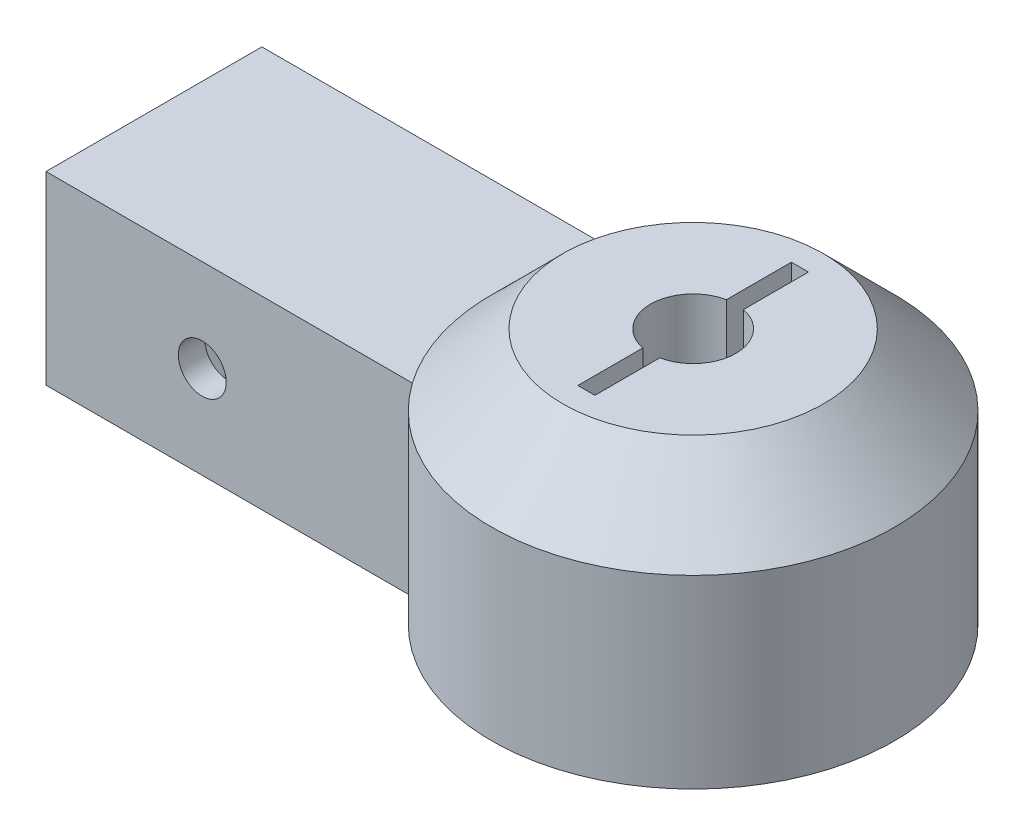
ISO-10303-21;
HEADER;
FILE_DESCRIPTION(('STEP AP214'),'2;1');
FILE_NAME('part.step','',(''),(''),'','','');
FILE_SCHEMA(('AUTOMOTIVE_DESIGN { 1 0 10303 214 1 1 1 1 }'));
ENDSEC;
DATA;
#1=APPLICATION_CONTEXT('core data for automotive mechanical design processes');
#2=APPLICATION_PROTOCOL_DEFINITION('international standard','automotive_design',2000,#1);
#3=PRODUCT_CONTEXT('',#1,'mechanical');
#4=PRODUCT('Part','Part','',(#3));
#5=PRODUCT_RELATED_PRODUCT_CATEGORY('part','',(#4));
#6=PRODUCT_DEFINITION_FORMATION('','',#4);
#7=PRODUCT_DEFINITION_CONTEXT('part definition',#1,'design');
#8=PRODUCT_DEFINITION('design','',#6,#7);
#9=PRODUCT_DEFINITION_SHAPE('','',#8);
#10=(LENGTH_UNIT() NAMED_UNIT(*) SI_UNIT(.MILLI.,.METRE.));
#11=(NAMED_UNIT(*) PLANE_ANGLE_UNIT() SI_UNIT($,.RADIAN.));
#12=(NAMED_UNIT(*) SI_UNIT($,.STERADIAN.) SOLID_ANGLE_UNIT());
#13=UNCERTAINTY_MEASURE_WITH_UNIT(LENGTH_MEASURE(1.E-05),#10,'distance_accuracy_value','');
#14=(GEOMETRIC_REPRESENTATION_CONTEXT(3) GLOBAL_UNCERTAINTY_ASSIGNED_CONTEXT((#13)) GLOBAL_UNIT_ASSIGNED_CONTEXT((#10,
#11,#12)) REPRESENTATION_CONTEXT('',''));
#15=CARTESIAN_POINT('',(0.,0.,0.));
#16=DIRECTION('',(0.,0.,1.));
#17=DIRECTION('',(1.,0.,0.));
#18=AXIS2_PLACEMENT_3D('',#15,#16,#17);
#19=CARTESIAN_POINT('',(0.,13.,0.));
#20=DIRECTION('',(0.,1.,0.));
#21=DIRECTION('',(0.,0.,1.));
#22=AXIS2_PLACEMENT_3D('',#19,#20,#21);
#23=PLANE('',#22);
#24=CARTESIAN_POINT('',(0.,13.,0.));
#25=DIRECTION('',(0.,1.,0.));
#26=DIRECTION('',(0.,0.,1.));
#27=AXIS2_PLACEMENT_3D('',#24,#25,#26);
#28=CIRCLE('',#27,14.15);
#29=CARTESIAN_POINT('',(-12.2972557914357,13.,-7.));
#30=VERTEX_POINT('',#29);
#31=CARTESIAN_POINT('',(-11.5594120985335,13.,8.16103497947882));
#32=VERTEX_POINT('',#31);
#33=EDGE_CURVE('E200',#30,#32,#28,.T.);
#34=ORIENTED_EDGE('',*,*,#33,.F.);
#35=DIRECTION('',(-1.,0.,0.));
#36=VECTOR('',#35,1.);
#37=CARTESIAN_POINT('',(-12.2972557914357,13.,-7.));
#38=LINE('',#37,#36);
#39=CARTESIAN_POINT('',(-37.2972557914357,13.,-7.));
#40=VERTEX_POINT('',#39);
#41=EDGE_CURVE('E344',#30,#40,#38,.T.);
#42=ORIENTED_EDGE('',*,*,#41,.T.);
#43=DIRECTION('',(0.,0.,1.));
#44=VECTOR('',#43,1.);
#45=CARTESIAN_POINT('',(-37.2972557914357,13.,8.16103497947882));
#46=LINE('',#45,#44);
#47=CARTESIAN_POINT('',(-37.2972557914357,13.,8.16103497947882));
#48=VERTEX_POINT('',#47);
#49=EDGE_CURVE('E346',#40,#48,#46,.T.);
#50=ORIENTED_EDGE('',*,*,#49,.T.);
#51=DIRECTION('',(1.,0.,0.));
#52=VECTOR('',#51,1.);
#53=CARTESIAN_POINT('',(-37.2972557914357,13.,8.16103497947882));
#54=LINE('',#53,#52);
#55=EDGE_CURVE('E349',#48,#32,#54,.T.);
#56=ORIENTED_EDGE('',*,*,#55,.T.);
#57=EDGE_LOOP('',(#34,#42,#50,#56));
#58=FACE_BOUND('',#57,.T.);
#59=ADVANCED_FACE('F33',(#58),#23,.T.);
#60=CARTESIAN_POINT('',(0.,0.,0.));
#61=DIRECTION('',(0.,1.,0.));
#62=DIRECTION('',(0.,0.,1.));
#63=AXIS2_PLACEMENT_3D('',#60,#61,#62);
#64=PLANE('',#63);
#65=CARTESIAN_POINT('',(0.,0.,0.));
#66=DIRECTION('',(0.,1.,0.));
#67=DIRECTION('',(0.,0.,1.));
#68=AXIS2_PLACEMENT_3D('',#65,#66,#67);
#69=CIRCLE('',#68,14.15);
#70=CARTESIAN_POINT('',(-11.5594120985335,0.,8.16103497947882));
#71=VERTEX_POINT('',#70);
#72=CARTESIAN_POINT('',(-12.2972557914357,0.,-7.));
#73=VERTEX_POINT('',#72);
#74=EDGE_CURVE('E343',#71,#73,#69,.T.);
#75=ORIENTED_EDGE('',*,*,#74,.F.);
#76=DIRECTION('',(1.,0.,0.));
#77=VECTOR('',#76,1.);
#78=CARTESIAN_POINT('',(-37.2972557914357,0.,8.16103497947882));
#79=LINE('',#78,#77);
#80=CARTESIAN_POINT('',(-37.2972557914357,0.,8.16103497947882));
#81=VERTEX_POINT('',#80);
#82=EDGE_CURVE('E347',#81,#71,#79,.T.);
#83=ORIENTED_EDGE('',*,*,#82,.F.);
#84=DIRECTION('',(0.,0.,1.));
#85=VECTOR('',#84,1.);
#86=CARTESIAN_POINT('',(-37.2972557914357,0.,8.16103497947882));
#87=LINE('',#86,#85);
#88=CARTESIAN_POINT('',(-37.2972557914357,0.,-7.));
#89=VERTEX_POINT('',#88);
#90=EDGE_CURVE('E357',#89,#81,#87,.T.);
#91=ORIENTED_EDGE('',*,*,#90,.F.);
#92=DIRECTION('',(-1.,0.,0.));
#93=VECTOR('',#92,1.);
#94=CARTESIAN_POINT('',(-12.2972557914357,0.,-7.));
#95=LINE('',#94,#93);
#96=EDGE_CURVE('E355',#73,#89,#95,.T.);
#97=ORIENTED_EDGE('',*,*,#96,.F.);
#98=EDGE_LOOP('',(#75,#83,#91,#97));
#99=FACE_BOUND('',#98,.T.);
#100=CARTESIAN_POINT('',(0.,0.,0.));
#101=DIRECTION('',(0.,1.,0.));
#102=DIRECTION('',(0.,0.,1.));
#103=AXIS2_PLACEMENT_3D('',#100,#101,#102);
#104=CIRCLE('',#103,11.15);
#105=CARTESIAN_POINT('',(0.,0.,-11.15));
#106=VERTEX_POINT('',#105);
#107=EDGE_CURVE('E333',#106,#106,#104,.T.);
#108=ORIENTED_EDGE('',*,*,#107,.T.);
#109=EDGE_LOOP('',(#108));
#110=FACE_BOUND('',#109,.T.);
#111=ADVANCED_FACE('F384',(#99,#110),#64,.F.);
#112=CARTESIAN_POINT('',(0.,13.,0.));
#113=DIRECTION('',(0.,-1.,0.));
#114=DIRECTION('',(0.,0.,-1.));
#115=AXIS2_PLACEMENT_3D('',#112,#113,#114);
#116=CYLINDRICAL_SURFACE('',#115,14.15);
#117=DIRECTION('',(0.,-1.,0.));
#118=VECTOR('',#117,1.);
#119=CARTESIAN_POINT('',(-12.2972557914357,13.,-7.));
#120=LINE('',#119,#118);
#121=EDGE_CURVE('E368',#30,#73,#120,.T.);
#122=ORIENTED_EDGE('',*,*,#121,.F.);
#123=CARTESIAN_POINT('',(0.,13.,0.));
#124=DIRECTION('',(0.,1.,0.));
#125=DIRECTION('',(0.,0.,1.));
#126=AXIS2_PLACEMENT_3D('',#123,#124,#125);
#127=CIRCLE('',#126,14.15);
#128=EDGE_CURVE('E11',#30,#32,#127,.F.);
#129=ORIENTED_EDGE('',*,*,#128,.T.);
#130=DIRECTION('',(0.,-1.,0.));
#131=VECTOR('',#130,1.);
#132=CARTESIAN_POINT('',(-11.5594120985335,13.,8.16103497947882));
#133=LINE('',#132,#131);
#134=EDGE_CURVE('E352',#32,#71,#133,.T.);
#135=ORIENTED_EDGE('',*,*,#134,.T.);
#136=ORIENTED_EDGE('',*,*,#74,.T.);
#137=EDGE_LOOP('',(#122,#129,#135,#136));
#138=FACE_BOUND('',#137,.T.);
#139=ADVANCED_FACE('F392',(#138),#116,.T.);
#140=CARTESIAN_POINT('',(-12.2972557914357,13.,-7.));
#141=DIRECTION('',(0.,0.,1.));
#142=DIRECTION('',(1.,0.,0.));
#143=AXIS2_PLACEMENT_3D('',#140,#141,#142);
#144=PLANE('',#143);
#145=ORIENTED_EDGE('',*,*,#96,.T.);
#146=DIRECTION('',(0.,-1.,0.));
#147=VECTOR('',#146,1.);
#148=CARTESIAN_POINT('',(-37.2972557914357,13.,-7.));
#149=LINE('',#148,#147);
#150=EDGE_CURVE('E365',#40,#89,#149,.T.);
#151=ORIENTED_EDGE('',*,*,#150,.F.);
#152=ORIENTED_EDGE('',*,*,#41,.F.);
#153=ORIENTED_EDGE('',*,*,#121,.T.);
#154=EDGE_LOOP('',(#145,#151,#152,#153));
#155=FACE_BOUND('',#154,.T.);
#156=ADVANCED_FACE('F407',(#155),#144,.F.);
#157=CARTESIAN_POINT('',(-37.2972557914357,13.,8.16103497947882));
#158=DIRECTION('',(1.,0.,0.));
#159=DIRECTION('',(0.,0.,-1.));
#160=AXIS2_PLACEMENT_3D('',#157,#158,#159);
#161=PLANE('',#160);
#162=DIRECTION('',(0.,0.,1.));
#163=VECTOR('',#162,1.);
#164=CARTESIAN_POINT('',(-37.2972557914357,3.,3.50000000000002));
#165=LINE('',#164,#163);
#166=CARTESIAN_POINT('',(-37.2972557914357,3.,-3.49999999999999));
#167=VERTEX_POINT('',#166);
#168=CARTESIAN_POINT('',(-37.2972557914357,3.,3.50000000000002));
#169=VERTEX_POINT('',#168);
#170=EDGE_CURVE('E323',#167,#169,#165,.T.);
#171=ORIENTED_EDGE('',*,*,#170,.F.);
#172=DIRECTION('',(0.,-1.,0.));
#173=VECTOR('',#172,1.);
#174=CARTESIAN_POINT('',(-37.2972557914357,3.,-3.49999999999998));
#175=LINE('',#174,#173);
#176=CARTESIAN_POINT('',(-37.2972557914357,10.,-3.49999999999998));
#177=VERTEX_POINT('',#176);
#178=EDGE_CURVE('E56',#177,#167,#175,.T.);
#179=ORIENTED_EDGE('',*,*,#178,.F.);
#180=DIRECTION('',(0.,0.,-1.));
#181=VECTOR('',#180,1.);
#182=CARTESIAN_POINT('',(-37.2972557914357,10.,3.50000000000002));
#183=LINE('',#182,#181);
#184=CARTESIAN_POINT('',(-37.2972557914357,10.,3.50000000000002));
#185=VERTEX_POINT('',#184);
#186=EDGE_CURVE('E312',#185,#177,#183,.T.);
#187=ORIENTED_EDGE('',*,*,#186,.F.);
#188=DIRECTION('',(0.,1.,0.));
#189=VECTOR('',#188,1.);
#190=CARTESIAN_POINT('',(-37.2972557914357,3.,3.50000000000002));
#191=LINE('',#190,#189);
#192=EDGE_CURVE('E326',#169,#185,#191,.T.);
#193=ORIENTED_EDGE('',*,*,#192,.F.);
#194=EDGE_LOOP('',(#171,#179,#187,#193));
#195=FACE_BOUND('',#194,.T.);
#196=ORIENTED_EDGE('',*,*,#90,.T.);
#197=DIRECTION('',(0.,-1.,0.));
#198=VECTOR('',#197,1.);
#199=CARTESIAN_POINT('',(-37.2972557914357,13.,8.16103497947882));
#200=LINE('',#199,#198);
#201=EDGE_CURVE('E362',#48,#81,#200,.T.);
#202=ORIENTED_EDGE('',*,*,#201,.F.);
#203=ORIENTED_EDGE('',*,*,#49,.F.);
#204=ORIENTED_EDGE('',*,*,#150,.T.);
#205=EDGE_LOOP('',(#196,#202,#203,#204));
#206=FACE_BOUND('',#205,.T.);
#207=ADVANCED_FACE('F403',(#195,#206),#161,.F.);
#208=CARTESIAN_POINT('',(-37.2972557914357,13.,8.16103497947882));
#209=DIRECTION('',(0.,0.,-1.));
#210=DIRECTION('',(-1.,0.,0.));
#211=AXIS2_PLACEMENT_3D('',#208,#209,#210);
#212=PLANE('',#211);
#213=CARTESIAN_POINT('',(-26.3212409424091,6.5,8.16103497947882));
#214=DIRECTION('',(0.,0.,-1.));
#215=DIRECTION('',(-1.,0.,0.));
#216=AXIS2_PLACEMENT_3D('',#213,#214,#215);
#217=CIRCLE('',#216,1.68366195753649);
#218=CARTESIAN_POINT('',(-28.0049028999456,6.5,8.16103497947882));
#219=VERTEX_POINT('',#218);
#220=EDGE_CURVE('E259',#219,#219,#217,.T.);
#221=ORIENTED_EDGE('',*,*,#220,.T.);
#222=EDGE_LOOP('',(#221));
#223=FACE_BOUND('',#222,.T.);
#224=ORIENTED_EDGE('',*,*,#82,.T.);
#225=ORIENTED_EDGE('',*,*,#134,.F.);
#226=ORIENTED_EDGE('',*,*,#55,.F.);
#227=ORIENTED_EDGE('',*,*,#201,.T.);
#228=EDGE_LOOP('',(#224,#225,#226,#227));
#229=FACE_BOUND('',#228,.T.);
#230=ADVANCED_FACE('F400',(#223,#229),#212,.F.);
#231=CARTESIAN_POINT('',(0.,13.,0.));
#232=DIRECTION('',(0.,-1.,0.));
#233=DIRECTION('',(0.,0.,-1.));
#234=AXIS2_PLACEMENT_3D('',#231,#232,#233);
#235=CYLINDRICAL_SURFACE('',#234,11.15);
#236=CARTESIAN_POINT('',(0.,13.,0.));
#237=DIRECTION('',(0.,1.,0.));
#238=DIRECTION('',(0.,0.,1.));
#239=AXIS2_PLACEMENT_3D('',#236,#237,#238);
#240=CIRCLE('',#239,11.15);
#241=CARTESIAN_POINT('',(0.,13.,-11.15));
#242=VERTEX_POINT('',#241);
#243=EDGE_CURVE('E255',#242,#242,#240,.T.);
#244=CARTESIAN_POINT('',(0.,13.,-11.15));
#245=CARTESIAN_POINT('',(0.,12.8645833333333,-11.15));
#246=CARTESIAN_POINT('',(0.,12.7291666666667,-11.15));
#247=CARTESIAN_POINT('',(0.,12.4583333333333,-11.15));
#248=CARTESIAN_POINT('',(0.,12.3229166666667,-11.15));
#249=CARTESIAN_POINT('',(0.,12.0520833333333,-11.15));
#250=CARTESIAN_POINT('',(0.,11.9166666666667,-11.15));
#251=CARTESIAN_POINT('',(0.,11.6458333333333,-11.15));
#252=CARTESIAN_POINT('',(0.,11.5104166666667,-11.15));
#253=CARTESIAN_POINT('',(0.,11.2395833333333,-11.15));
#254=CARTESIAN_POINT('',(0.,11.1041666666667,-11.15));
#255=CARTESIAN_POINT('',(0.,10.8333333333333,-11.15));
#256=CARTESIAN_POINT('',(0.,10.6979166666667,-11.15));
#257=CARTESIAN_POINT('',(0.,10.4270833333333,-11.15));
#258=CARTESIAN_POINT('',(0.,10.2916666666667,-11.15));
#259=CARTESIAN_POINT('',(0.,10.0208333333333,-11.15));
#260=CARTESIAN_POINT('',(0.,9.88541666666667,-11.15));
#261=CARTESIAN_POINT('',(0.,9.61458333333333,-11.15));
#262=CARTESIAN_POINT('',(0.,9.47916666666667,-11.15));
#263=CARTESIAN_POINT('',(0.,9.20833333333333,-11.15));
#264=CARTESIAN_POINT('',(0.,9.07291666666667,-11.15));
#265=CARTESIAN_POINT('',(0.,8.80208333333333,-11.15));
#266=CARTESIAN_POINT('',(0.,8.66666666666667,-11.15));
#267=CARTESIAN_POINT('',(0.,8.39583333333333,-11.15));
#268=CARTESIAN_POINT('',(0.,8.26041666666667,-11.15));
#269=CARTESIAN_POINT('',(0.,7.98958333333333,-11.15));
#270=CARTESIAN_POINT('',(0.,7.85416666666667,-11.15));
#271=CARTESIAN_POINT('',(0.,7.58333333333333,-11.15));
#272=CARTESIAN_POINT('',(0.,7.44791666666667,-11.15));
#273=CARTESIAN_POINT('',(0.,7.17708333333333,-11.15));
#274=CARTESIAN_POINT('',(0.,7.04166666666667,-11.15));
#275=CARTESIAN_POINT('',(0.,6.77083333333333,-11.15));
#276=CARTESIAN_POINT('',(0.,6.63541666666667,-11.15));
#277=CARTESIAN_POINT('',(0.,6.36458333333333,-11.15));
#278=CARTESIAN_POINT('',(0.,6.22916666666667,-11.15));
#279=CARTESIAN_POINT('',(0.,5.95833333333333,-11.15));
#280=CARTESIAN_POINT('',(0.,5.82291666666667,-11.15));
#281=CARTESIAN_POINT('',(0.,5.55208333333333,-11.15));
#282=CARTESIAN_POINT('',(0.,5.41666666666667,-11.15));
#283=CARTESIAN_POINT('',(0.,5.14583333333333,-11.15));
#284=CARTESIAN_POINT('',(0.,5.01041666666667,-11.15));
#285=CARTESIAN_POINT('',(0.,4.73958333333333,-11.15));
#286=CARTESIAN_POINT('',(0.,4.60416666666667,-11.15));
#287=CARTESIAN_POINT('',(0.,4.33333333333333,-11.15));
#288=CARTESIAN_POINT('',(0.,4.19791666666667,-11.15));
#289=CARTESIAN_POINT('',(0.,3.92708333333333,-11.15));
#290=CARTESIAN_POINT('',(0.,3.79166666666667,-11.15));
#291=CARTESIAN_POINT('',(0.,3.52083333333333,-11.15));
#292=CARTESIAN_POINT('',(0.,3.38541666666667,-11.15));
#293=CARTESIAN_POINT('',(0.,3.11458333333333,-11.15));
#294=CARTESIAN_POINT('',(0.,2.97916666666667,-11.15));
#295=CARTESIAN_POINT('',(0.,2.70833333333333,-11.15));
#296=CARTESIAN_POINT('',(0.,2.57291666666667,-11.15));
#297=CARTESIAN_POINT('',(0.,2.30208333333333,-11.15));
#298=CARTESIAN_POINT('',(0.,2.16666666666667,-11.15));
#299=CARTESIAN_POINT('',(0.,1.89583333333333,-11.15));
#300=CARTESIAN_POINT('',(0.,1.76041666666667,-11.15));
#301=CARTESIAN_POINT('',(0.,1.48958333333333,-11.15));
#302=CARTESIAN_POINT('',(0.,1.35416666666667,-11.15));
#303=CARTESIAN_POINT('',(0.,1.08333333333333,-11.15));
#304=CARTESIAN_POINT('',(0.,0.947916666666667,-11.15));
#305=CARTESIAN_POINT('',(0.,0.677083333333334,-11.15));
#306=CARTESIAN_POINT('',(0.,0.541666666666667,-11.15));
#307=CARTESIAN_POINT('',(0.,0.270833333333334,-11.15));
#308=CARTESIAN_POINT('',(0.,0.135416666666667,-11.15));
#309=CARTESIAN_POINT('',(0.,0.,-11.15));
#310=B_SPLINE_CURVE_WITH_KNOTS('',3,(#244,#245,#246,#247,#248,#249,#250,#251,#252,#253,#254,
#255,#256,#257,#258,#259,#260,#261,#262,#263,#264,#265,#266,#267,#268,#269,#270,#271,#272,#273,
#274,#275,#276,#277,#278,#279,#280,#281,#282,#283,#284,#285,#286,#287,#288,#289,#290,#291,#292,
#293,#294,#295,#296,#297,#298,#299,#300,#301,#302,#303,#304,#305,#306,#307,#308,#309),
.UNSPECIFIED.,.F.,.F.,(4,2,2,2,2,2,2,2,2,2,2,2,2,2,2,2,2,2,2,2,2,2,2,2,2,2,2,2,2,2,2,2,4),(0.,
0.406249999999999,0.812499999999999,1.21875,1.625,2.03125,2.4375,2.84375,3.25,3.65625,4.0625,
4.46875,4.875,5.28125,5.6875,6.09375,6.5,6.90625,7.3125,7.71875,8.125,8.53125,8.9375,9.34375,
9.75,10.15625,10.5625,10.96875,11.375,11.78125,12.1875,12.59375,13.),.UNSPECIFIED.);
#311=EDGE_CURVE('BSEAM397',#242,#106,#310,.T.);
#312=ORIENTED_EDGE('',*,*,#243,.T.);
#313=ORIENTED_EDGE('',*,*,#107,.F.);
#314=ORIENTED_EDGE('',*,*,#311,.T.);
#315=ORIENTED_EDGE('',*,*,#311,.F.);
#316=EDGE_LOOP('',(#312,#314,#313,#315));
#317=FACE_BOUND('',#316,.T.);
#318=ADVANCED_FACE('F397',(#317),#235,.F.);
#319=CARTESIAN_POINT('',(-11.2972557914357,3.,-3.49999999999998));
#320=DIRECTION('',(0.,0.,-1.));
#321=DIRECTION('',(-1.,0.,0.));
#322=AXIS2_PLACEMENT_3D('',#319,#320,#321);
#323=PLANE('',#322);
#324=ORIENTED_EDGE('',*,*,#178,.T.);
#325=DIRECTION('',(-1.,0.,0.));
#326=VECTOR('',#325,1.);
#327=CARTESIAN_POINT('',(-11.2972557914357,3.,-3.49999999999998));
#328=LINE('',#327,#326);
#329=CARTESIAN_POINT('',(-11.2972557914357,3.,-3.49999999999998));
#330=VERTEX_POINT('',#329);
#331=EDGE_CURVE('E321',#330,#167,#328,.T.);
#332=ORIENTED_EDGE('',*,*,#331,.F.);
#333=DIRECTION('',(0.,-1.,0.));
#334=VECTOR('',#333,1.);
#335=CARTESIAN_POINT('',(-11.2972557914357,3.,-3.49999999999998));
#336=LINE('',#335,#334);
#337=CARTESIAN_POINT('',(-11.2972557914357,10.,-3.49999999999998));
#338=VERTEX_POINT('',#337);
#339=EDGE_CURVE('E308',#338,#330,#336,.T.);
#340=ORIENTED_EDGE('',*,*,#339,.F.);
#341=DIRECTION('',(-1.,0.,0.));
#342=VECTOR('',#341,1.);
#343=CARTESIAN_POINT('',(-11.2972557914357,10.,-3.49999999999998));
#344=LINE('',#343,#342);
#345=EDGE_CURVE('E331',#338,#177,#344,.T.);
#346=ORIENTED_EDGE('',*,*,#345,.T.);
#347=EDGE_LOOP('',(#324,#332,#340,#346));
#348=FACE_BOUND('',#347,.T.);
#349=ADVANCED_FACE('F432',(#348),#323,.F.);
#350=CARTESIAN_POINT('',(-11.2972557914357,10.,3.50000000000002));
#351=DIRECTION('',(0.,1.,0.));
#352=DIRECTION('',(0.,0.,1.));
#353=AXIS2_PLACEMENT_3D('',#350,#351,#352);
#354=PLANE('',#353);
#355=ORIENTED_EDGE('',*,*,#186,.T.);
#356=ORIENTED_EDGE('',*,*,#345,.F.);
#357=DIRECTION('',(0.,0.,-1.));
#358=VECTOR('',#357,1.);
#359=CARTESIAN_POINT('',(-11.2972557914357,10.,3.50000000000002));
#360=LINE('',#359,#358);
#361=CARTESIAN_POINT('',(-11.2972557914357,10.,3.50000000000002));
#362=VERTEX_POINT('',#361);
#363=EDGE_CURVE('E318',#362,#338,#360,.T.);
#364=ORIENTED_EDGE('',*,*,#363,.F.);
#365=DIRECTION('',(-1.,0.,0.));
#366=VECTOR('',#365,1.);
#367=CARTESIAN_POINT('',(-11.2972557914357,10.,3.50000000000002));
#368=LINE('',#367,#366);
#369=EDGE_CURVE('E334',#362,#185,#368,.T.);
#370=ORIENTED_EDGE('',*,*,#369,.T.);
#371=EDGE_LOOP('',(#355,#356,#364,#370));
#372=FACE_BOUND('',#371,.T.);
#373=ADVANCED_FACE('F438',(#372),#354,.F.);
#374=CARTESIAN_POINT('',(-11.2972557914357,3.,3.50000000000002));
#375=DIRECTION('',(0.,0.,1.));
#376=DIRECTION('',(1.,0.,0.));
#377=AXIS2_PLACEMENT_3D('',#374,#375,#376);
#378=PLANE('',#377);
#379=DIRECTION('',(-0.5,-0.866025403784439,0.));
#380=VECTOR('',#379,1.);
#381=CARTESIAN_POINT('',(-22.6261992195955,6.5,3.50000000000002));
#382=LINE('',#381,#380);
#383=CARTESIAN_POINT('',(-22.6261992195955,6.5,3.50000000000002));
#384=VERTEX_POINT('',#383);
#385=CARTESIAN_POINT('',(-24.4737200810023,3.3,3.50000000000002));
#386=VERTEX_POINT('',#385);
#387=EDGE_CURVE('E283',#384,#386,#382,.T.);
#388=ORIENTED_EDGE('',*,*,#387,.F.);
#389=DIRECTION('',(0.5,-0.866025403784439,0.));
#390=VECTOR('',#389,1.);
#391=CARTESIAN_POINT('',(-24.4737200810023,9.70000000000001,3.50000000000002));
#392=LINE('',#391,#390);
#393=CARTESIAN_POINT('',(-24.4737200810023,9.70000000000001,3.50000000000002));
#394=VERTEX_POINT('',#393);
#395=EDGE_CURVE('E48',#394,#384,#392,.T.);
#396=ORIENTED_EDGE('',*,*,#395,.F.);
#397=DIRECTION('',(1.,0.,0.));
#398=VECTOR('',#397,1.);
#399=CARTESIAN_POINT('',(-28.168761803816,9.7,3.50000000000002));
#400=LINE('',#399,#398);
#401=CARTESIAN_POINT('',(-28.168761803816,9.7,3.50000000000002));
#402=VERTEX_POINT('',#401);
#403=EDGE_CURVE('E266',#402,#394,#400,.T.);
#404=ORIENTED_EDGE('',*,*,#403,.F.);
#405=DIRECTION('',(0.500000000000001,0.866025403784438,0.));
#406=VECTOR('',#405,1.);
#407=CARTESIAN_POINT('',(-30.0162826652228,6.50000000000001,3.50000000000002));
#408=LINE('',#407,#406);
#409=CARTESIAN_POINT('',(-30.0162826652228,6.50000000000001,3.50000000000002));
#410=VERTEX_POINT('',#409);
#411=EDGE_CURVE('E292',#410,#402,#408,.T.);
#412=ORIENTED_EDGE('',*,*,#411,.F.);
#413=DIRECTION('',(-0.499999999999999,0.866025403784439,0.));
#414=VECTOR('',#413,1.);
#415=CARTESIAN_POINT('',(-28.168761803816,3.3,3.50000000000002));
#416=LINE('',#415,#414);
#417=CARTESIAN_POINT('',(-28.168761803816,3.3,3.50000000000002));
#418=VERTEX_POINT('',#417);
#419=EDGE_CURVE('E289',#418,#410,#416,.T.);
#420=ORIENTED_EDGE('',*,*,#419,.F.);
#421=DIRECTION('',(-1.,0.,0.));
#422=VECTOR('',#421,1.);
#423=CARTESIAN_POINT('',(-24.4737200810023,3.3,3.50000000000002));
#424=LINE('',#423,#422);
#425=EDGE_CURVE('E286',#386,#418,#424,.T.);
#426=ORIENTED_EDGE('',*,*,#425,.F.);
#427=EDGE_LOOP('',(#388,#396,#404,#412,#420,#426));
#428=FACE_BOUND('',#427,.T.);
#429=ORIENTED_EDGE('',*,*,#192,.T.);
#430=ORIENTED_EDGE('',*,*,#369,.F.);
#431=DIRECTION('',(0.,1.,0.));
#432=VECTOR('',#431,1.);
#433=CARTESIAN_POINT('',(-11.2972557914357,3.,3.50000000000002));
#434=LINE('',#433,#432);
#435=CARTESIAN_POINT('',(-11.2972557914357,3.,3.50000000000002));
#436=VERTEX_POINT('',#435);
#437=EDGE_CURVE('E315',#436,#362,#434,.T.);
#438=ORIENTED_EDGE('',*,*,#437,.F.);
#439=DIRECTION('',(-1.,0.,0.));
#440=VECTOR('',#439,1.);
#441=CARTESIAN_POINT('',(-11.2972557914357,3.,3.50000000000002));
#442=LINE('',#441,#440);
#443=EDGE_CURVE('E336',#436,#169,#442,.T.);
#444=ORIENTED_EDGE('',*,*,#443,.T.);
#445=EDGE_LOOP('',(#429,#430,#438,#444));
#446=FACE_BOUND('',#445,.T.);
#447=ADVANCED_FACE('F517',(#428,#446),#378,.F.);
#448=CARTESIAN_POINT('',(-11.2972557914357,3.,3.50000000000002));
#449=DIRECTION('',(0.,-1.,0.));
#450=DIRECTION('',(0.,0.,-1.));
#451=AXIS2_PLACEMENT_3D('',#448,#449,#450);
#452=PLANE('',#451);
#453=ORIENTED_EDGE('',*,*,#170,.T.);
#454=ORIENTED_EDGE('',*,*,#443,.F.);
#455=DIRECTION('',(0.,0.,1.));
#456=VECTOR('',#455,1.);
#457=CARTESIAN_POINT('',(-11.2972557914357,3.,3.50000000000002));
#458=LINE('',#457,#456);
#459=EDGE_CURVE('E311',#330,#436,#458,.T.);
#460=ORIENTED_EDGE('',*,*,#459,.F.);
#461=ORIENTED_EDGE('',*,*,#331,.T.);
#462=EDGE_LOOP('',(#453,#454,#460,#461));
#463=FACE_BOUND('',#462,.T.);
#464=ADVANCED_FACE('F513',(#463),#452,.F.);
#465=CARTESIAN_POINT('',(-11.2972557914357,0.,0.));
#466=DIRECTION('',(-1.,0.,0.));
#467=DIRECTION('',(0.,0.,1.));
#468=AXIS2_PLACEMENT_3D('',#465,#466,#467);
#469=PLANE('',#468);
#470=ORIENTED_EDGE('',*,*,#339,.T.);
#471=ORIENTED_EDGE('',*,*,#459,.T.);
#472=ORIENTED_EDGE('',*,*,#437,.T.);
#473=ORIENTED_EDGE('',*,*,#363,.T.);
#474=EDGE_LOOP('',(#470,#471,#472,#473));
#475=FACE_BOUND('',#474,.T.);
#476=ADVANCED_FACE('F510',(#475),#469,.T.);
#477=CARTESIAN_POINT('',(-24.4737200810023,9.70000000000001,6.30000000000002));
#478=DIRECTION('',(0.866025403784438,0.5,0.));
#479=DIRECTION('',(-0.5,0.866025403784439,0.));
#480=AXIS2_PLACEMENT_3D('',#477,#478,#479);
#481=PLANE('',#480);
#482=ORIENTED_EDGE('',*,*,#395,.T.);
#483=DIRECTION('',(0.,0.,-1.));
#484=VECTOR('',#483,1.);
#485=CARTESIAN_POINT('',(-22.6261992195955,6.5,6.30000000000002));
#486=LINE('',#485,#484);
#487=CARTESIAN_POINT('',(-22.6261992195955,6.5,6.30000000000002));
#488=VERTEX_POINT('',#487);
#489=EDGE_CURVE('E281',#488,#384,#486,.T.);
#490=ORIENTED_EDGE('',*,*,#489,.F.);
#491=DIRECTION('',(0.5,-0.866025403784439,0.));
#492=VECTOR('',#491,1.);
#493=CARTESIAN_POINT('',(-24.4737200810023,9.70000000000001,6.30000000000002));
#494=LINE('',#493,#492);
#495=CARTESIAN_POINT('',(-24.4737200810023,9.70000000000001,6.30000000000002));
#496=VERTEX_POINT('',#495);
#497=EDGE_CURVE('E262',#496,#488,#494,.T.);
#498=ORIENTED_EDGE('',*,*,#497,.F.);
#499=DIRECTION('',(0.,0.,-1.));
#500=VECTOR('',#499,1.);
#501=CARTESIAN_POINT('',(-24.4737200810023,9.70000000000001,6.30000000000002));
#502=LINE('',#501,#500);
#503=EDGE_CURVE('E297',#496,#394,#502,.T.);
#504=ORIENTED_EDGE('',*,*,#503,.T.);
#505=EDGE_LOOP('',(#482,#490,#498,#504));
#506=FACE_BOUND('',#505,.T.);
#507=ADVANCED_FACE('F492',(#506),#481,.F.);
#508=CARTESIAN_POINT('',(-28.168761803816,9.7,6.30000000000002));
#509=DIRECTION('',(0.,1.,0.));
#510=DIRECTION('',(-1.,0.,0.));
#511=AXIS2_PLACEMENT_3D('',#508,#509,#510);
#512=PLANE('',#511);
#513=ORIENTED_EDGE('',*,*,#403,.T.);
#514=ORIENTED_EDGE('',*,*,#503,.F.);
#515=DIRECTION('',(1.,0.,0.));
#516=VECTOR('',#515,1.);
#517=CARTESIAN_POINT('',(-28.168761803816,9.7,6.30000000000002));
#518=LINE('',#517,#516);
#519=CARTESIAN_POINT('',(-28.168761803816,9.7,6.30000000000002));
#520=VERTEX_POINT('',#519);
#521=EDGE_CURVE('E278',#520,#496,#518,.T.);
#522=ORIENTED_EDGE('',*,*,#521,.F.);
#523=DIRECTION('',(0.,0.,-1.));
#524=VECTOR('',#523,1.);
#525=CARTESIAN_POINT('',(-28.168761803816,9.7,6.30000000000002));
#526=LINE('',#525,#524);
#527=EDGE_CURVE('E299',#520,#402,#526,.T.);
#528=ORIENTED_EDGE('',*,*,#527,.T.);
#529=EDGE_LOOP('',(#513,#514,#522,#528));
#530=FACE_BOUND('',#529,.T.);
#531=ADVANCED_FACE('F488',(#530),#512,.F.);
#532=CARTESIAN_POINT('',(-30.0162826652228,6.50000000000001,6.30000000000002));
#533=DIRECTION('',(-0.866025403784438,0.500000000000001,0.));
#534=DIRECTION('',(-0.500000000000001,-0.866025403784438,0.));
#535=AXIS2_PLACEMENT_3D('',#532,#533,#534);
#536=PLANE('',#535);
#537=ORIENTED_EDGE('',*,*,#411,.T.);
#538=ORIENTED_EDGE('',*,*,#527,.F.);
#539=DIRECTION('',(0.500000000000001,0.866025403784438,0.));
#540=VECTOR('',#539,1.);
#541=CARTESIAN_POINT('',(-30.0162826652228,6.50000000000001,6.30000000000002));
#542=LINE('',#541,#540);
#543=CARTESIAN_POINT('',(-30.0162826652228,6.50000000000001,6.30000000000002));
#544=VERTEX_POINT('',#543);
#545=EDGE_CURVE('E275',#544,#520,#542,.T.);
#546=ORIENTED_EDGE('',*,*,#545,.F.);
#547=DIRECTION('',(0.,0.,-1.));
#548=VECTOR('',#547,1.);
#549=CARTESIAN_POINT('',(-30.0162826652228,6.50000000000001,6.30000000000002));
#550=LINE('',#549,#548);
#551=EDGE_CURVE('E301',#544,#410,#550,.T.);
#552=ORIENTED_EDGE('',*,*,#551,.T.);
#553=EDGE_LOOP('',(#537,#538,#546,#552));
#554=FACE_BOUND('',#553,.T.);
#555=ADVANCED_FACE('F491',(#554),#536,.F.);
#556=CARTESIAN_POINT('',(-28.168761803816,3.3,6.30000000000002));
#557=DIRECTION('',(-0.866025403784439,-0.499999999999999,0.));
#558=DIRECTION('',(0.499999999999999,-0.866025403784439,0.));
#559=AXIS2_PLACEMENT_3D('',#556,#557,#558);
#560=PLANE('',#559);
#561=ORIENTED_EDGE('',*,*,#419,.T.);
#562=ORIENTED_EDGE('',*,*,#551,.F.);
#563=DIRECTION('',(-0.499999999999999,0.866025403784439,0.));
#564=VECTOR('',#563,1.);
#565=CARTESIAN_POINT('',(-28.168761803816,3.3,6.30000000000002));
#566=LINE('',#565,#564);
#567=CARTESIAN_POINT('',(-28.168761803816,3.3,6.30000000000002));
#568=VERTEX_POINT('',#567);
#569=EDGE_CURVE('E272',#568,#544,#566,.T.);
#570=ORIENTED_EDGE('',*,*,#569,.F.);
#571=DIRECTION('',(0.,0.,-1.));
#572=VECTOR('',#571,1.);
#573=CARTESIAN_POINT('',(-28.168761803816,3.3,6.30000000000002));
#574=LINE('',#573,#572);
#575=EDGE_CURVE('E303',#568,#418,#574,.T.);
#576=ORIENTED_EDGE('',*,*,#575,.T.);
#577=EDGE_LOOP('',(#561,#562,#570,#576));
#578=FACE_BOUND('',#577,.T.);
#579=ADVANCED_FACE('F496',(#578),#560,.F.);
#580=CARTESIAN_POINT('',(-24.4737200810023,3.3,6.30000000000002));
#581=DIRECTION('',(0.,-1.,0.));
#582=DIRECTION('',(1.,0.,0.));
#583=AXIS2_PLACEMENT_3D('',#580,#581,#582);
#584=PLANE('',#583);
#585=ORIENTED_EDGE('',*,*,#425,.T.);
#586=ORIENTED_EDGE('',*,*,#575,.F.);
#587=DIRECTION('',(-1.,0.,0.));
#588=VECTOR('',#587,1.);
#589=CARTESIAN_POINT('',(-24.4737200810023,3.3,6.30000000000002));
#590=LINE('',#589,#588);
#591=CARTESIAN_POINT('',(-24.4737200810023,3.3,6.30000000000002));
#592=VERTEX_POINT('',#591);
#593=EDGE_CURVE('E269',#592,#568,#590,.T.);
#594=ORIENTED_EDGE('',*,*,#593,.F.);
#595=DIRECTION('',(0.,0.,-1.));
#596=VECTOR('',#595,1.);
#597=CARTESIAN_POINT('',(-24.4737200810023,3.3,6.30000000000002));
#598=LINE('',#597,#596);
#599=EDGE_CURVE('E305',#592,#386,#598,.T.);
#600=ORIENTED_EDGE('',*,*,#599,.T.);
#601=EDGE_LOOP('',(#585,#586,#594,#600));
#602=FACE_BOUND('',#601,.T.);
#603=ADVANCED_FACE('F500',(#602),#584,.F.);
#604=CARTESIAN_POINT('',(-22.6261992195955,6.5,6.30000000000002));
#605=DIRECTION('',(0.866025403784439,-0.5,0.));
#606=DIRECTION('',(0.5,0.866025403784439,0.));
#607=AXIS2_PLACEMENT_3D('',#604,#605,#606);
#608=PLANE('',#607);
#609=ORIENTED_EDGE('',*,*,#387,.T.);
#610=ORIENTED_EDGE('',*,*,#599,.F.);
#611=DIRECTION('',(-0.5,-0.866025403784439,0.));
#612=VECTOR('',#611,1.);
#613=CARTESIAN_POINT('',(-22.6261992195955,6.5,6.30000000000002));
#614=LINE('',#613,#612);
#615=EDGE_CURVE('E265',#488,#592,#614,.T.);
#616=ORIENTED_EDGE('',*,*,#615,.F.);
#617=ORIENTED_EDGE('',*,*,#489,.T.);
#618=EDGE_LOOP('',(#609,#610,#616,#617));
#619=FACE_BOUND('',#618,.T.);
#620=ADVANCED_FACE('F486',(#619),#608,.F.);
#621=CARTESIAN_POINT('',(0.,0.,6.30000000000002));
#622=DIRECTION('',(0.,0.,-1.));
#623=DIRECTION('',(-1.,0.,0.));
#624=AXIS2_PLACEMENT_3D('',#621,#622,#623);
#625=PLANE('',#624);
#626=CARTESIAN_POINT('',(-26.3212409424091,6.5,6.30000000000002));
#627=DIRECTION('',(0.,0.,-1.));
#628=DIRECTION('',(-1.,0.,0.));
#629=AXIS2_PLACEMENT_3D('',#626,#627,#628);
#630=CIRCLE('',#629,1.68366195753649);
#631=CARTESIAN_POINT('',(-28.0049028999456,6.5,6.30000000000002));
#632=VERTEX_POINT('',#631);
#633=EDGE_CURVE('E256',#632,#632,#630,.T.);
#634=ORIENTED_EDGE('',*,*,#633,.F.);
#635=EDGE_LOOP('',(#634));
#636=FACE_BOUND('',#635,.T.);
#637=ORIENTED_EDGE('',*,*,#497,.T.);
#638=ORIENTED_EDGE('',*,*,#615,.T.);
#639=ORIENTED_EDGE('',*,*,#593,.T.);
#640=ORIENTED_EDGE('',*,*,#569,.T.);
#641=ORIENTED_EDGE('',*,*,#545,.T.);
#642=ORIENTED_EDGE('',*,*,#521,.T.);
#643=EDGE_LOOP('',(#637,#638,#639,#640,#641,#642));
#644=FACE_BOUND('',#643,.T.);
#645=ADVANCED_FACE('F482',(#636,#644),#625,.T.);
#646=CARTESIAN_POINT('',(-26.3212409424091,6.5,9.10000000000002));
#647=DIRECTION('',(0.,0.,-1.));
#648=DIRECTION('',(-1.,0.,0.));
#649=AXIS2_PLACEMENT_3D('',#646,#647,#648);
#650=CYLINDRICAL_SURFACE('',#649,1.68366195753649);
#651=ORIENTED_EDGE('',*,*,#633,.T.);
#652=EDGE_LOOP('',(#651));
#653=FACE_BOUND('',#652,.T.);
#654=ORIENTED_EDGE('',*,*,#220,.F.);
#655=EDGE_LOOP('',(#654));
#656=FACE_BOUND('',#655,.T.);
#657=ADVANCED_FACE('F479',(#653,#656),#650,.F.);
#658=CARTESIAN_POINT('',(0.,18.,0.));
#659=DIRECTION('',(0.,1.,0.));
#660=DIRECTION('',(0.,0.,1.));
#661=AXIS2_PLACEMENT_3D('',#658,#659,#660);
#662=PLANE('',#661);
#663=CARTESIAN_POINT('',(0.,18.,0.));
#664=DIRECTION('',(0.,1.,0.));
#665=DIRECTION('',(0.,0.,1.));
#666=AXIS2_PLACEMENT_3D('',#663,#664,#665);
#667=CIRCLE('',#666,9.15000000000001);
#668=CARTESIAN_POINT('',(0.,18.,9.15000000000001));
#669=VERTEX_POINT('',#668);
#670=EDGE_CURVE('E41',#669,#669,#667,.T.);
#671=ORIENTED_EDGE('',*,*,#670,.T.);
#672=EDGE_LOOP('',(#671));
#673=FACE_BOUND('',#672,.T.);
#674=DIRECTION('',(0.,0.,1.));
#675=VECTOR('',#674,1.);
#676=CARTESIAN_POINT('',(-0.6,18.,7.5));
#677=LINE('',#676,#675);
#678=CARTESIAN_POINT('',(-0.6,18.,2.93938769133981));
#679=VERTEX_POINT('',#678);
#680=CARTESIAN_POINT('',(-0.6,18.,7.5));
#681=VERTEX_POINT('',#680);
#682=EDGE_CURVE('E192',#679,#681,#677,.T.);
#683=ORIENTED_EDGE('',*,*,#682,.F.);
#684=CARTESIAN_POINT('',(0.,18.,0.));
#685=DIRECTION('',(0.,1.,0.));
#686=DIRECTION('',(0.,0.,1.));
#687=AXIS2_PLACEMENT_3D('',#684,#685,#686);
#688=CIRCLE('',#687,3.);
#689=CARTESIAN_POINT('',(-0.6,18.,-2.93938769133981));
#690=VERTEX_POINT('',#689);
#691=EDGE_CURVE('E182',#690,#679,#688,.T.);
#692=ORIENTED_EDGE('',*,*,#691,.F.);
#693=DIRECTION('',(0.,0.,1.));
#694=VECTOR('',#693,1.);
#695=CARTESIAN_POINT('',(-0.6,18.,-2.93938769133981));
#696=LINE('',#695,#694);
#697=CARTESIAN_POINT('',(-0.6,18.,-7.5));
#698=VERTEX_POINT('',#697);
#699=EDGE_CURVE('E219',#698,#690,#696,.T.);
#700=ORIENTED_EDGE('',*,*,#699,.F.);
#701=DIRECTION('',(-1.,0.,0.));
#702=VECTOR('',#701,1.);
#703=CARTESIAN_POINT('',(0.6,18.,-7.5));
#704=LINE('',#703,#702);
#705=CARTESIAN_POINT('',(0.6,18.,-7.5));
#706=VERTEX_POINT('',#705);
#707=EDGE_CURVE('E216',#706,#698,#704,.T.);
#708=ORIENTED_EDGE('',*,*,#707,.F.);
#709=DIRECTION('',(0.,0.,-1.));
#710=VECTOR('',#709,1.);
#711=CARTESIAN_POINT('',(0.6,18.,-2.93938769133981));
#712=LINE('',#711,#710);
#713=CARTESIAN_POINT('',(0.6,18.,-2.93938769133981));
#714=VERTEX_POINT('',#713);
#715=EDGE_CURVE('E214',#714,#706,#712,.T.);
#716=ORIENTED_EDGE('',*,*,#715,.F.);
#717=CARTESIAN_POINT('',(0.,18.,0.));
#718=DIRECTION('',(0.,1.,0.));
#719=DIRECTION('',(0.,0.,1.));
#720=AXIS2_PLACEMENT_3D('',#717,#718,#719);
#721=CIRCLE('',#720,3.);
#722=CARTESIAN_POINT('',(0.6,18.,2.93938769133981));
#723=VERTEX_POINT('',#722);
#724=EDGE_CURVE('E212',#723,#714,#721,.T.);
#725=ORIENTED_EDGE('',*,*,#724,.F.);
#726=DIRECTION('',(0.,0.,-1.));
#727=VECTOR('',#726,1.);
#728=CARTESIAN_POINT('',(0.6,18.,7.5));
#729=LINE('',#728,#727);
#730=CARTESIAN_POINT('',(0.6,18.,7.5));
#731=VERTEX_POINT('',#730);
#732=EDGE_CURVE('E208',#731,#723,#729,.T.);
#733=ORIENTED_EDGE('',*,*,#732,.F.);
#734=DIRECTION('',(1.,0.,0.));
#735=VECTOR('',#734,1.);
#736=CARTESIAN_POINT('',(0.6,18.,7.5));
#737=LINE('',#736,#735);
#738=EDGE_CURVE('E206',#681,#731,#737,.T.);
#739=ORIENTED_EDGE('',*,*,#738,.F.);
#740=EDGE_LOOP('',(#683,#692,#700,#708,#716,#725,#733,#739));
#741=FACE_BOUND('',#740,.T.);
#742=ADVANCED_FACE('F204',(#673,#741),#662,.T.);
#743=CARTESIAN_POINT('',(0.,13.,0.));
#744=DIRECTION('',(0.,1.,0.));
#745=DIRECTION('',(0.,0.,1.));
#746=AXIS2_PLACEMENT_3D('',#743,#744,#745);
#747=PLANE('',#746);
#748=ORIENTED_EDGE('',*,*,#243,.F.);
#749=EDGE_LOOP('',(#748));
#750=FACE_BOUND('',#749,.T.);
#751=CARTESIAN_POINT('',(0.,13.,0.));
#752=DIRECTION('',(0.,1.,0.));
#753=DIRECTION('',(0.,0.,1.));
#754=AXIS2_PLACEMENT_3D('',#751,#752,#753);
#755=CIRCLE('',#754,3.);
#756=CARTESIAN_POINT('',(-0.6,13.,-2.93938769133981));
#757=VERTEX_POINT('',#756);
#758=CARTESIAN_POINT('',(-0.6,13.,2.93938769133981));
#759=VERTEX_POINT('',#758);
#760=EDGE_CURVE('E221',#757,#759,#755,.T.);
#761=ORIENTED_EDGE('',*,*,#760,.T.);
#762=DIRECTION('',(0.,0.,1.));
#763=VECTOR('',#762,1.);
#764=CARTESIAN_POINT('',(-0.6,13.,7.5));
#765=LINE('',#764,#763);
#766=CARTESIAN_POINT('',(-0.6,13.,7.5));
#767=VERTEX_POINT('',#766);
#768=EDGE_CURVE('E199',#759,#767,#765,.T.);
#769=ORIENTED_EDGE('',*,*,#768,.T.);
#770=DIRECTION('',(1.,0.,0.));
#771=VECTOR('',#770,1.);
#772=CARTESIAN_POINT('',(0.6,13.,7.5));
#773=LINE('',#772,#771);
#774=CARTESIAN_POINT('',(0.6,13.,7.5));
#775=VERTEX_POINT('',#774);
#776=EDGE_CURVE('E224',#767,#775,#773,.T.);
#777=ORIENTED_EDGE('',*,*,#776,.T.);
#778=DIRECTION('',(0.,0.,-1.));
#779=VECTOR('',#778,1.);
#780=CARTESIAN_POINT('',(0.6,13.,7.5));
#781=LINE('',#780,#779);
#782=CARTESIAN_POINT('',(0.6,13.,2.93938769133981));
#783=VERTEX_POINT('',#782);
#784=EDGE_CURVE('E227',#775,#783,#781,.T.);
#785=ORIENTED_EDGE('',*,*,#784,.T.);
#786=CARTESIAN_POINT('',(0.,13.,0.));
#787=DIRECTION('',(0.,1.,0.));
#788=DIRECTION('',(0.,0.,1.));
#789=AXIS2_PLACEMENT_3D('',#786,#787,#788);
#790=CIRCLE('',#789,3.);
#791=CARTESIAN_POINT('',(0.6,13.,-2.93938769133981));
#792=VERTEX_POINT('',#791);
#793=EDGE_CURVE('E230',#783,#792,#790,.T.);
#794=ORIENTED_EDGE('',*,*,#793,.T.);
#795=DIRECTION('',(0.,0.,-1.));
#796=VECTOR('',#795,1.);
#797=CARTESIAN_POINT('',(0.6,13.,-2.93938769133981));
#798=LINE('',#797,#796);
#799=CARTESIAN_POINT('',(0.6,13.,-7.5));
#800=VERTEX_POINT('',#799);
#801=EDGE_CURVE('E233',#792,#800,#798,.T.);
#802=ORIENTED_EDGE('',*,*,#801,.T.);
#803=DIRECTION('',(-1.,0.,0.));
#804=VECTOR('',#803,1.);
#805=CARTESIAN_POINT('',(0.6,13.,-7.5));
#806=LINE('',#805,#804);
#807=CARTESIAN_POINT('',(-0.6,13.,-7.5));
#808=VERTEX_POINT('',#807);
#809=EDGE_CURVE('E236',#800,#808,#806,.T.);
#810=ORIENTED_EDGE('',*,*,#809,.T.);
#811=DIRECTION('',(0.,0.,1.));
#812=VECTOR('',#811,1.);
#813=CARTESIAN_POINT('',(-0.6,13.,-2.93938769133981));
#814=LINE('',#813,#812);
#815=EDGE_CURVE('E193',#808,#757,#814,.T.);
#816=ORIENTED_EDGE('',*,*,#815,.T.);
#817=EDGE_LOOP('',(#761,#769,#777,#785,#794,#802,#810,#816));
#818=FACE_BOUND('',#817,.T.);
#819=ADVANCED_FACE('F441',(#750,#818),#747,.F.);
#820=CARTESIAN_POINT('',(0.,18.,0.));
#821=DIRECTION('',(0.,-1.,0.));
#822=DIRECTION('',(0.,0.,-1.));
#823=AXIS2_PLACEMENT_3D('',#820,#821,#822);
#824=CYLINDRICAL_SURFACE('',#823,3.);
#825=ORIENTED_EDGE('',*,*,#760,.F.);
#826=DIRECTION('',(0.,-1.,0.));
#827=VECTOR('',#826,1.);
#828=CARTESIAN_POINT('',(-0.6,18.,-2.93938769133981));
#829=LINE('',#828,#827);
#830=EDGE_CURVE('E188',#690,#757,#829,.T.);
#831=ORIENTED_EDGE('',*,*,#830,.F.);
#832=ORIENTED_EDGE('',*,*,#691,.T.);
#833=DIRECTION('',(0.,-1.,0.));
#834=VECTOR('',#833,1.);
#835=CARTESIAN_POINT('',(-0.6,18.,2.93938769133981));
#836=LINE('',#835,#834);
#837=EDGE_CURVE('E185',#679,#759,#836,.T.);
#838=ORIENTED_EDGE('',*,*,#837,.T.);
#839=EDGE_LOOP('',(#825,#831,#832,#838));
#840=FACE_BOUND('',#839,.T.);
#841=ADVANCED_FACE('F184',(#840),#824,.F.);
#842=CARTESIAN_POINT('',(-0.6,18.,7.5));
#843=DIRECTION('',(1.,0.,0.));
#844=DIRECTION('',(0.,0.,-1.));
#845=AXIS2_PLACEMENT_3D('',#842,#843,#844);
#846=PLANE('',#845);
#847=ORIENTED_EDGE('',*,*,#768,.F.);
#848=ORIENTED_EDGE('',*,*,#837,.F.);
#849=ORIENTED_EDGE('',*,*,#682,.T.);
#850=DIRECTION('',(0.,-1.,0.));
#851=VECTOR('',#850,1.);
#852=CARTESIAN_POINT('',(-0.6,18.,7.5));
#853=LINE('',#852,#851);
#854=EDGE_CURVE('E201',#681,#767,#853,.T.);
#855=ORIENTED_EDGE('',*,*,#854,.T.);
#856=EDGE_LOOP('',(#847,#848,#849,#855));
#857=FACE_BOUND('',#856,.T.);
#858=ADVANCED_FACE('F196',(#857),#846,.T.);
#859=CARTESIAN_POINT('',(0.6,18.,7.5));
#860=DIRECTION('',(0.,0.,-1.));
#861=DIRECTION('',(-1.,0.,0.));
#862=AXIS2_PLACEMENT_3D('',#859,#860,#861);
#863=PLANE('',#862);
#864=ORIENTED_EDGE('',*,*,#776,.F.);
#865=ORIENTED_EDGE('',*,*,#854,.F.);
#866=ORIENTED_EDGE('',*,*,#738,.T.);
#867=DIRECTION('',(0.,-1.,0.));
#868=VECTOR('',#867,1.);
#869=CARTESIAN_POINT('',(0.6,18.,7.5));
#870=LINE('',#869,#868);
#871=EDGE_CURVE('E250',#731,#775,#870,.T.);
#872=ORIENTED_EDGE('',*,*,#871,.T.);
#873=EDGE_LOOP('',(#864,#865,#866,#872));
#874=FACE_BOUND('',#873,.T.);
#875=ADVANCED_FACE('F466',(#874),#863,.T.);
#876=CARTESIAN_POINT('',(0.6,18.,7.5));
#877=DIRECTION('',(-1.,0.,0.));
#878=DIRECTION('',(0.,0.,1.));
#879=AXIS2_PLACEMENT_3D('',#876,#877,#878);
#880=PLANE('',#879);
#881=ORIENTED_EDGE('',*,*,#784,.F.);
#882=ORIENTED_EDGE('',*,*,#871,.F.);
#883=ORIENTED_EDGE('',*,*,#732,.T.);
#884=DIRECTION('',(0.,-1.,0.));
#885=VECTOR('',#884,1.);
#886=CARTESIAN_POINT('',(0.6,18.,2.93938769133981));
#887=LINE('',#886,#885);
#888=EDGE_CURVE('E248',#723,#783,#887,.T.);
#889=ORIENTED_EDGE('',*,*,#888,.T.);
#890=EDGE_LOOP('',(#881,#882,#883,#889));
#891=FACE_BOUND('',#890,.T.);
#892=ADVANCED_FACE('F463',(#891),#880,.T.);
#893=CARTESIAN_POINT('',(0.,18.,0.));
#894=DIRECTION('',(0.,-1.,0.));
#895=DIRECTION('',(0.,0.,-1.));
#896=AXIS2_PLACEMENT_3D('',#893,#894,#895);
#897=CYLINDRICAL_SURFACE('',#896,3.);
#898=ORIENTED_EDGE('',*,*,#793,.F.);
#899=ORIENTED_EDGE('',*,*,#888,.F.);
#900=ORIENTED_EDGE('',*,*,#724,.T.);
#901=DIRECTION('',(0.,-1.,0.));
#902=VECTOR('',#901,1.);
#903=CARTESIAN_POINT('',(0.6,18.,-2.93938769133981));
#904=LINE('',#903,#902);
#905=EDGE_CURVE('E246',#714,#792,#904,.T.);
#906=ORIENTED_EDGE('',*,*,#905,.T.);
#907=EDGE_LOOP('',(#898,#899,#900,#906));
#908=FACE_BOUND('',#907,.T.);
#909=ADVANCED_FACE('F458',(#908),#897,.F.);
#910=CARTESIAN_POINT('',(0.6,18.,-2.93938769133981));
#911=DIRECTION('',(-1.,0.,0.));
#912=DIRECTION('',(0.,0.,1.));
#913=AXIS2_PLACEMENT_3D('',#910,#911,#912);
#914=PLANE('',#913);
#915=ORIENTED_EDGE('',*,*,#801,.F.);
#916=ORIENTED_EDGE('',*,*,#905,.F.);
#917=ORIENTED_EDGE('',*,*,#715,.T.);
#918=DIRECTION('',(0.,-1.,0.));
#919=VECTOR('',#918,1.);
#920=CARTESIAN_POINT('',(0.6,18.,-7.5));
#921=LINE('',#920,#919);
#922=EDGE_CURVE('E244',#706,#800,#921,.T.);
#923=ORIENTED_EDGE('',*,*,#922,.T.);
#924=EDGE_LOOP('',(#915,#916,#917,#923));
#925=FACE_BOUND('',#924,.T.);
#926=ADVANCED_FACE('F454',(#925),#914,.T.);
#927=CARTESIAN_POINT('',(0.6,18.,-7.5));
#928=DIRECTION('',(0.,0.,1.));
#929=DIRECTION('',(1.,0.,0.));
#930=AXIS2_PLACEMENT_3D('',#927,#928,#929);
#931=PLANE('',#930);
#932=ORIENTED_EDGE('',*,*,#809,.F.);
#933=ORIENTED_EDGE('',*,*,#922,.F.);
#934=ORIENTED_EDGE('',*,*,#707,.T.);
#935=DIRECTION('',(0.,-1.,0.));
#936=VECTOR('',#935,1.);
#937=CARTESIAN_POINT('',(-0.6,18.,-7.5));
#938=LINE('',#937,#936);
#939=EDGE_CURVE('E242',#698,#808,#938,.T.);
#940=ORIENTED_EDGE('',*,*,#939,.T.);
#941=EDGE_LOOP('',(#932,#933,#934,#940));
#942=FACE_BOUND('',#941,.T.);
#943=ADVANCED_FACE('F380',(#942),#931,.T.);
#944=CARTESIAN_POINT('',(-0.6,18.,-2.93938769133981));
#945=DIRECTION('',(1.,0.,0.));
#946=DIRECTION('',(0.,0.,-1.));
#947=AXIS2_PLACEMENT_3D('',#944,#945,#946);
#948=PLANE('',#947);
#949=ORIENTED_EDGE('',*,*,#815,.F.);
#950=ORIENTED_EDGE('',*,*,#939,.F.);
#951=ORIENTED_EDGE('',*,*,#699,.T.);
#952=ORIENTED_EDGE('',*,*,#830,.T.);
#953=EDGE_LOOP('',(#949,#950,#951,#952));
#954=FACE_BOUND('',#953,.T.);
#955=ADVANCED_FACE('F375',(#954),#948,.T.);
#956=CARTESIAN_POINT('',(0.,18.,0.));
#957=DIRECTION('',(0.,-1.,0.));
#958=DIRECTION('',(0.,0.,-1.));
#959=AXIS2_PLACEMENT_3D('',#956,#957,#958);
#960=CONICAL_SURFACE('',#959,9.15000000000001,0.785398163397447);
#961=ORIENTED_EDGE('',*,*,#128,.F.);
#962=ORIENTED_EDGE('',*,*,#33,.T.);
#963=EDGE_LOOP('',(#961,#962));
#964=FACE_BOUND('',#963,.T.);
#965=ORIENTED_EDGE('',*,*,#670,.F.);
#966=EDGE_LOOP('',(#965));
#967=FACE_BOUND('',#966,.T.);
#968=ADVANCED_FACE('F35',(#964,#967),#960,.T.);
#969=CLOSED_SHELL('',(#59,#111,#139,#156,#207,#230,#318,#349,#373,#447,#464,#476,#507,#531,#555,
#579,#603,#620,#645,#657,#742,#819,#841,#858,#875,#892,#909,#926,#943,#955,#968));
#970=MANIFOLD_SOLID_BREP('B2',#969);
#971=ADVANCED_BREP_SHAPE_REPRESENTATION('',(#18,#970),#14);
#972=SHAPE_DEFINITION_REPRESENTATION(#9,#971);
ENDSEC;
END-ISO-10303-21;
